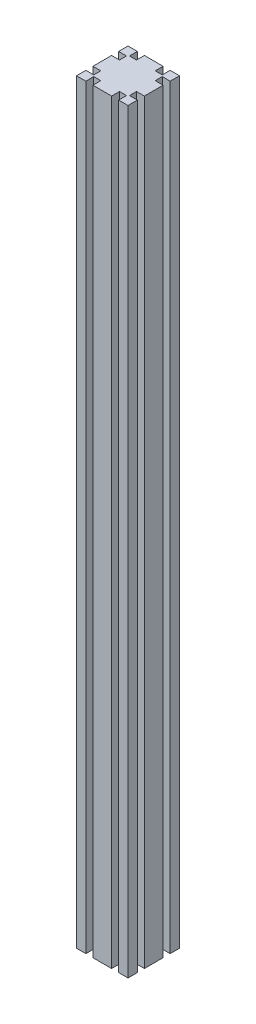
ISO-10303-21;
HEADER;
FILE_DESCRIPTION(('STEP AP214'),'2;1');
FILE_NAME('part.step','',(''),(''),'','','');
FILE_SCHEMA(('AUTOMOTIVE_DESIGN { 1 0 10303 214 1 1 1 1 }'));
ENDSEC;
DATA;
#1=APPLICATION_CONTEXT('core data for automotive mechanical design processes');
#2=APPLICATION_PROTOCOL_DEFINITION('international standard','automotive_design',2000,#1);
#3=PRODUCT_CONTEXT('',#1,'mechanical');
#4=PRODUCT('Part','Part','',(#3));
#5=PRODUCT_RELATED_PRODUCT_CATEGORY('part','',(#4));
#6=PRODUCT_DEFINITION_FORMATION('','',#4);
#7=PRODUCT_DEFINITION_CONTEXT('part definition',#1,'design');
#8=PRODUCT_DEFINITION('design','',#6,#7);
#9=PRODUCT_DEFINITION_SHAPE('','',#8);
#10=(LENGTH_UNIT() NAMED_UNIT(*) SI_UNIT(.MILLI.,.METRE.));
#11=(NAMED_UNIT(*) PLANE_ANGLE_UNIT() SI_UNIT($,.RADIAN.));
#12=(NAMED_UNIT(*) SI_UNIT($,.STERADIAN.) SOLID_ANGLE_UNIT());
#13=UNCERTAINTY_MEASURE_WITH_UNIT(LENGTH_MEASURE(1.E-05),#10,'distance_accuracy_value','');
#14=(GEOMETRIC_REPRESENTATION_CONTEXT(3) GLOBAL_UNCERTAINTY_ASSIGNED_CONTEXT((#13)) GLOBAL_UNIT_ASSIGNED_CONTEXT((#10,
#11,#12)) REPRESENTATION_CONTEXT('',''));
#15=CARTESIAN_POINT('',(0.,0.,0.));
#16=DIRECTION('',(0.,0.,1.));
#17=DIRECTION('',(1.,0.,0.));
#18=AXIS2_PLACEMENT_3D('',#15,#16,#17);
#19=CARTESIAN_POINT('',(19.1,880.,0.));
#20=DIRECTION('',(-1.,0.,0.));
#21=DIRECTION('',(0.,0.,1.));
#22=AXIS2_PLACEMENT_3D('',#19,#20,#21);
#23=PLANE('',#22);
#24=DIRECTION('',(0.,0.,-1.));
#25=VECTOR('',#24,1.);
#26=CARTESIAN_POINT('',(19.1,0.,0.));
#27=LINE('',#26,#25);
#28=CARTESIAN_POINT('',(19.1,0.,-50.8));
#29=VERTEX_POINT('',#28);
#30=CARTESIAN_POINT('',(19.1,0.,-60.));
#31=VERTEX_POINT('',#30);
#32=EDGE_CURVE('E298',#29,#31,#27,.T.);
#33=ORIENTED_EDGE('',*,*,#32,.F.);
#34=DIRECTION('',(0.,-1.,0.));
#35=VECTOR('',#34,1.);
#36=CARTESIAN_POINT('',(19.1,880.,-50.8));
#37=LINE('',#36,#35);
#38=CARTESIAN_POINT('',(19.1,880.,-50.8));
#39=VERTEX_POINT('',#38);
#40=EDGE_CURVE('E11',#39,#29,#37,.T.);
#41=ORIENTED_EDGE('',*,*,#40,.F.);
#42=DIRECTION('',(0.,0.,-1.));
#43=VECTOR('',#42,1.);
#44=CARTESIAN_POINT('',(19.1,880.,0.));
#45=LINE('',#44,#43);
#46=CARTESIAN_POINT('',(19.1,880.,-60.));
#47=VERTEX_POINT('',#46);
#48=EDGE_CURVE('E478',#39,#47,#45,.T.);
#49=ORIENTED_EDGE('',*,*,#48,.T.);
#50=DIRECTION('',(0.,-1.,0.));
#51=VECTOR('',#50,1.);
#52=CARTESIAN_POINT('',(19.1,880.,-60.));
#53=LINE('',#52,#51);
#54=EDGE_CURVE('E51',#47,#31,#53,.T.);
#55=ORIENTED_EDGE('',*,*,#54,.T.);
#56=EDGE_LOOP('',(#33,#41,#49,#55));
#57=FACE_BOUND('',#56,.T.);
#58=ADVANCED_FACE('F35',(#57),#23,.T.);
#59=CARTESIAN_POINT('',(0.,880.,-50.8));
#60=DIRECTION('',(0.,0.,-1.));
#61=DIRECTION('',(-1.,0.,0.));
#62=AXIS2_PLACEMENT_3D('',#59,#60,#61);
#63=PLANE('',#62);
#64=DIRECTION('',(1.,0.,0.));
#65=VECTOR('',#64,1.);
#66=CARTESIAN_POINT('',(0.,0.,-50.8));
#67=LINE('',#66,#65);
#68=CARTESIAN_POINT('',(10.9,0.,-50.8));
#69=VERTEX_POINT('',#68);
#70=EDGE_CURVE('E300',#69,#29,#67,.T.);
#71=ORIENTED_EDGE('',*,*,#70,.F.);
#72=DIRECTION('',(0.,-1.,0.));
#73=VECTOR('',#72,1.);
#74=CARTESIAN_POINT('',(10.9,880.,-50.8));
#75=LINE('',#74,#73);
#76=CARTESIAN_POINT('',(10.9,880.,-50.8));
#77=VERTEX_POINT('',#76);
#78=EDGE_CURVE('E43',#77,#69,#75,.T.);
#79=ORIENTED_EDGE('',*,*,#78,.F.);
#80=DIRECTION('',(1.,0.,0.));
#81=VECTOR('',#80,1.);
#82=CARTESIAN_POINT('',(0.,880.,-50.8));
#83=LINE('',#82,#81);
#84=EDGE_CURVE('E475',#77,#39,#83,.T.);
#85=ORIENTED_EDGE('',*,*,#84,.T.);
#86=ORIENTED_EDGE('',*,*,#40,.T.);
#87=EDGE_LOOP('',(#71,#79,#85,#86));
#88=FACE_BOUND('',#87,.T.);
#89=ADVANCED_FACE('F464',(#88),#63,.T.);
#90=CARTESIAN_POINT('',(10.9,880.,0.));
#91=DIRECTION('',(1.,0.,0.));
#92=DIRECTION('',(0.,0.,-1.));
#93=AXIS2_PLACEMENT_3D('',#90,#91,#92);
#94=PLANE('',#93);
#95=DIRECTION('',(0.,0.,1.));
#96=VECTOR('',#95,1.);
#97=CARTESIAN_POINT('',(10.9,0.,0.));
#98=LINE('',#97,#96);
#99=CARTESIAN_POINT('',(10.9,0.,-60.));
#100=VERTEX_POINT('',#99);
#101=EDGE_CURVE('E303',#100,#69,#98,.T.);
#102=ORIENTED_EDGE('',*,*,#101,.F.);
#103=DIRECTION('',(0.,-1.,0.));
#104=VECTOR('',#103,1.);
#105=CARTESIAN_POINT('',(10.9,880.,-60.));
#106=LINE('',#105,#104);
#107=CARTESIAN_POINT('',(10.9,880.,-60.));
#108=VERTEX_POINT('',#107);
#109=EDGE_CURVE('E453',#108,#100,#106,.T.);
#110=ORIENTED_EDGE('',*,*,#109,.F.);
#111=DIRECTION('',(0.,0.,1.));
#112=VECTOR('',#111,1.);
#113=CARTESIAN_POINT('',(10.9,880.,0.));
#114=LINE('',#113,#112);
#115=EDGE_CURVE('E460',#108,#77,#114,.T.);
#116=ORIENTED_EDGE('',*,*,#115,.T.);
#117=ORIENTED_EDGE('',*,*,#78,.T.);
#118=EDGE_LOOP('',(#102,#110,#116,#117));
#119=FACE_BOUND('',#118,.T.);
#120=ADVANCED_FACE('F458',(#119),#94,.T.);
#121=CARTESIAN_POINT('',(0.,880.,-60.));
#122=DIRECTION('',(0.,0.,-1.));
#123=DIRECTION('',(-1.,0.,0.));
#124=AXIS2_PLACEMENT_3D('',#121,#122,#123);
#125=PLANE('',#124);
#126=DIRECTION('',(1.,0.,0.));
#127=VECTOR('',#126,1.);
#128=CARTESIAN_POINT('',(0.,0.,-60.));
#129=LINE('',#128,#127);
#130=CARTESIAN_POINT('',(0.,0.,-60.));
#131=VERTEX_POINT('',#130);
#132=EDGE_CURVE('E306',#131,#100,#129,.T.);
#133=ORIENTED_EDGE('',*,*,#132,.F.);
#134=DIRECTION('',(0.,-1.,0.));
#135=VECTOR('',#134,1.);
#136=CARTESIAN_POINT('',(0.,880.,-60.));
#137=LINE('',#136,#135);
#138=CARTESIAN_POINT('',(0.,880.,-60.));
#139=VERTEX_POINT('',#138);
#140=EDGE_CURVE('E451',#139,#131,#137,.T.);
#141=ORIENTED_EDGE('',*,*,#140,.F.);
#142=DIRECTION('',(1.,0.,0.));
#143=VECTOR('',#142,1.);
#144=CARTESIAN_POINT('',(0.,880.,-60.));
#145=LINE('',#144,#143);
#146=EDGE_CURVE('E295',#139,#108,#145,.T.);
#147=ORIENTED_EDGE('',*,*,#146,.T.);
#148=ORIENTED_EDGE('',*,*,#109,.T.);
#149=EDGE_LOOP('',(#133,#141,#147,#148));
#150=FACE_BOUND('',#149,.T.);
#151=ADVANCED_FACE('F471',(#150),#125,.T.);
#152=CARTESIAN_POINT('',(0.,880.,0.));
#153=DIRECTION('',(1.,0.,0.));
#154=DIRECTION('',(0.,0.,-1.));
#155=AXIS2_PLACEMENT_3D('',#152,#153,#154);
#156=PLANE('',#155);
#157=DIRECTION('',(0.,0.,1.));
#158=VECTOR('',#157,1.);
#159=CARTESIAN_POINT('',(0.,0.,0.));
#160=LINE('',#159,#158);
#161=CARTESIAN_POINT('',(0.,0.,-49.1));
#162=VERTEX_POINT('',#161);
#163=EDGE_CURVE('E309',#131,#162,#160,.T.);
#164=ORIENTED_EDGE('',*,*,#163,.T.);
#165=DIRECTION('',(0.,-1.,0.));
#166=VECTOR('',#165,1.);
#167=CARTESIAN_POINT('',(0.,880.,-49.1));
#168=LINE('',#167,#166);
#169=CARTESIAN_POINT('',(0.,880.,-49.1));
#170=VERTEX_POINT('',#169);
#171=EDGE_CURVE('E448',#170,#162,#168,.T.);
#172=ORIENTED_EDGE('',*,*,#171,.F.);
#173=DIRECTION('',(0.,0.,1.));
#174=VECTOR('',#173,1.);
#175=CARTESIAN_POINT('',(0.,880.,0.));
#176=LINE('',#175,#174);
#177=EDGE_CURVE('E477',#139,#170,#176,.T.);
#178=ORIENTED_EDGE('',*,*,#177,.F.);
#179=ORIENTED_EDGE('',*,*,#140,.T.);
#180=EDGE_LOOP('',(#164,#172,#178,#179));
#181=FACE_BOUND('',#180,.T.);
#182=ADVANCED_FACE('F600',(#181),#156,.F.);
#183=CARTESIAN_POINT('',(0.,880.,-49.1));
#184=DIRECTION('',(0.,0.,-1.));
#185=DIRECTION('',(-1.,0.,0.));
#186=AXIS2_PLACEMENT_3D('',#183,#184,#185);
#187=PLANE('',#186);
#188=DIRECTION('',(1.,0.,0.));
#189=VECTOR('',#188,1.);
#190=CARTESIAN_POINT('',(0.,0.,-49.1));
#191=LINE('',#190,#189);
#192=CARTESIAN_POINT('',(9.2,0.,-49.1));
#193=VERTEX_POINT('',#192);
#194=EDGE_CURVE('E312',#162,#193,#191,.T.);
#195=ORIENTED_EDGE('',*,*,#194,.T.);
#196=DIRECTION('',(0.,-1.,0.));
#197=VECTOR('',#196,1.);
#198=CARTESIAN_POINT('',(9.2,880.,-49.1));
#199=LINE('',#198,#197);
#200=CARTESIAN_POINT('',(9.2,880.,-49.1));
#201=VERTEX_POINT('',#200);
#202=EDGE_CURVE('E445',#201,#193,#199,.T.);
#203=ORIENTED_EDGE('',*,*,#202,.F.);
#204=DIRECTION('',(1.,0.,0.));
#205=VECTOR('',#204,1.);
#206=CARTESIAN_POINT('',(0.,880.,-49.1));
#207=LINE('',#206,#205);
#208=EDGE_CURVE('E483',#170,#201,#207,.T.);
#209=ORIENTED_EDGE('',*,*,#208,.F.);
#210=ORIENTED_EDGE('',*,*,#171,.T.);
#211=EDGE_LOOP('',(#195,#203,#209,#210));
#212=FACE_BOUND('',#211,.T.);
#213=ADVANCED_FACE('F605',(#212),#187,.F.);
#214=CARTESIAN_POINT('',(9.20000000000001,880.,0.));
#215=DIRECTION('',(1.,0.,0.));
#216=DIRECTION('',(0.,0.,-1.));
#217=AXIS2_PLACEMENT_3D('',#214,#215,#216);
#218=PLANE('',#217);
#219=DIRECTION('',(0.,0.,1.));
#220=VECTOR('',#219,1.);
#221=CARTESIAN_POINT('',(9.20000000000001,0.,0.));
#222=LINE('',#221,#220);
#223=CARTESIAN_POINT('',(9.2,0.,-40.9));
#224=VERTEX_POINT('',#223);
#225=EDGE_CURVE('E314',#193,#224,#222,.T.);
#226=ORIENTED_EDGE('',*,*,#225,.T.);
#227=DIRECTION('',(0.,-1.,0.));
#228=VECTOR('',#227,1.);
#229=CARTESIAN_POINT('',(9.2,880.,-40.9));
#230=LINE('',#229,#228);
#231=CARTESIAN_POINT('',(9.2,880.,-40.9));
#232=VERTEX_POINT('',#231);
#233=EDGE_CURVE('E442',#232,#224,#230,.T.);
#234=ORIENTED_EDGE('',*,*,#233,.F.);
#235=DIRECTION('',(0.,0.,1.));
#236=VECTOR('',#235,1.);
#237=CARTESIAN_POINT('',(9.20000000000001,880.,0.));
#238=LINE('',#237,#236);
#239=EDGE_CURVE('E485',#201,#232,#238,.T.);
#240=ORIENTED_EDGE('',*,*,#239,.F.);
#241=ORIENTED_EDGE('',*,*,#202,.T.);
#242=EDGE_LOOP('',(#226,#234,#240,#241));
#243=FACE_BOUND('',#242,.T.);
#244=ADVANCED_FACE('F614',(#243),#218,.F.);
#245=CARTESIAN_POINT('',(0.,880.,-40.9));
#246=DIRECTION('',(0.,0.,1.));
#247=DIRECTION('',(1.,0.,0.));
#248=AXIS2_PLACEMENT_3D('',#245,#246,#247);
#249=PLANE('',#248);
#250=DIRECTION('',(-1.,0.,0.));
#251=VECTOR('',#250,1.);
#252=CARTESIAN_POINT('',(0.,0.,-40.9));
#253=LINE('',#252,#251);
#254=CARTESIAN_POINT('',(0.,0.,-40.9));
#255=VERTEX_POINT('',#254);
#256=EDGE_CURVE('E316',#224,#255,#253,.T.);
#257=ORIENTED_EDGE('',*,*,#256,.T.);
#258=DIRECTION('',(0.,-1.,0.));
#259=VECTOR('',#258,1.);
#260=CARTESIAN_POINT('',(0.,880.,-40.9));
#261=LINE('',#260,#259);
#262=CARTESIAN_POINT('',(0.,880.,-40.9));
#263=VERTEX_POINT('',#262);
#264=EDGE_CURVE('E440',#263,#255,#261,.T.);
#265=ORIENTED_EDGE('',*,*,#264,.F.);
#266=DIRECTION('',(-1.,0.,0.));
#267=VECTOR('',#266,1.);
#268=CARTESIAN_POINT('',(0.,880.,-40.9));
#269=LINE('',#268,#267);
#270=EDGE_CURVE('E487',#232,#263,#269,.T.);
#271=ORIENTED_EDGE('',*,*,#270,.F.);
#272=ORIENTED_EDGE('',*,*,#233,.T.);
#273=EDGE_LOOP('',(#257,#265,#271,#272));
#274=FACE_BOUND('',#273,.T.);
#275=ADVANCED_FACE('F618',(#274),#249,.F.);
#276=CARTESIAN_POINT('',(0.,880.,0.));
#277=DIRECTION('',(-1.,0.,0.));
#278=DIRECTION('',(0.,0.,1.));
#279=AXIS2_PLACEMENT_3D('',#276,#277,#278);
#280=PLANE('',#279);
#281=DIRECTION('',(0.,0.,-1.));
#282=VECTOR('',#281,1.);
#283=CARTESIAN_POINT('',(0.,0.,0.));
#284=LINE('',#283,#282);
#285=CARTESIAN_POINT('',(0.,0.,-19.1));
#286=VERTEX_POINT('',#285);
#287=EDGE_CURVE('E319',#286,#255,#284,.T.);
#288=ORIENTED_EDGE('',*,*,#287,.F.);
#289=DIRECTION('',(0.,-1.,0.));
#290=VECTOR('',#289,1.);
#291=CARTESIAN_POINT('',(0.,880.,-19.1));
#292=LINE('',#291,#290);
#293=CARTESIAN_POINT('',(0.,880.,-19.1));
#294=VERTEX_POINT('',#293);
#295=EDGE_CURVE('E438',#294,#286,#292,.T.);
#296=ORIENTED_EDGE('',*,*,#295,.F.);
#297=DIRECTION('',(0.,0.,-1.));
#298=VECTOR('',#297,1.);
#299=CARTESIAN_POINT('',(0.,880.,0.));
#300=LINE('',#299,#298);
#301=EDGE_CURVE('E489',#294,#263,#300,.T.);
#302=ORIENTED_EDGE('',*,*,#301,.T.);
#303=ORIENTED_EDGE('',*,*,#264,.T.);
#304=EDGE_LOOP('',(#288,#296,#302,#303));
#305=FACE_BOUND('',#304,.T.);
#306=ADVANCED_FACE('F622',(#305),#280,.T.);
#307=CARTESIAN_POINT('',(0.,880.,-19.1));
#308=DIRECTION('',(0.,0.,1.));
#309=DIRECTION('',(1.,0.,0.));
#310=AXIS2_PLACEMENT_3D('',#307,#308,#309);
#311=PLANE('',#310);
#312=DIRECTION('',(-1.,0.,0.));
#313=VECTOR('',#312,1.);
#314=CARTESIAN_POINT('',(0.,0.,-19.1));
#315=LINE('',#314,#313);
#316=CARTESIAN_POINT('',(9.20000000000002,0.,-19.1));
#317=VERTEX_POINT('',#316);
#318=EDGE_CURVE('E322',#317,#286,#315,.T.);
#319=ORIENTED_EDGE('',*,*,#318,.F.);
#320=DIRECTION('',(0.,-1.,0.));
#321=VECTOR('',#320,1.);
#322=CARTESIAN_POINT('',(9.20000000000002,880.,-19.1));
#323=LINE('',#322,#321);
#324=CARTESIAN_POINT('',(9.20000000000002,880.,-19.1));
#325=VERTEX_POINT('',#324);
#326=EDGE_CURVE('E436',#325,#317,#323,.T.);
#327=ORIENTED_EDGE('',*,*,#326,.F.);
#328=DIRECTION('',(-1.,0.,0.));
#329=VECTOR('',#328,1.);
#330=CARTESIAN_POINT('',(0.,880.,-19.1));
#331=LINE('',#330,#329);
#332=EDGE_CURVE('E492',#325,#294,#331,.T.);
#333=ORIENTED_EDGE('',*,*,#332,.T.);
#334=ORIENTED_EDGE('',*,*,#295,.T.);
#335=EDGE_LOOP('',(#319,#327,#333,#334));
#336=FACE_BOUND('',#335,.T.);
#337=ADVANCED_FACE('F626',(#336),#311,.T.);
#338=CARTESIAN_POINT('',(9.2,880.,0.));
#339=DIRECTION('',(-1.,0.,0.));
#340=DIRECTION('',(0.,0.,1.));
#341=AXIS2_PLACEMENT_3D('',#338,#339,#340);
#342=PLANE('',#341);
#343=DIRECTION('',(0.,0.,-1.));
#344=VECTOR('',#343,1.);
#345=CARTESIAN_POINT('',(9.2,0.,0.));
#346=LINE('',#345,#344);
#347=CARTESIAN_POINT('',(9.20000000000001,0.,-10.9));
#348=VERTEX_POINT('',#347);
#349=EDGE_CURVE('E325',#348,#317,#346,.T.);
#350=ORIENTED_EDGE('',*,*,#349,.F.);
#351=DIRECTION('',(0.,-1.,0.));
#352=VECTOR('',#351,1.);
#353=CARTESIAN_POINT('',(9.20000000000001,880.,-10.9));
#354=LINE('',#353,#352);
#355=CARTESIAN_POINT('',(9.20000000000001,880.,-10.9));
#356=VERTEX_POINT('',#355);
#357=EDGE_CURVE('E434',#356,#348,#354,.T.);
#358=ORIENTED_EDGE('',*,*,#357,.F.);
#359=DIRECTION('',(0.,0.,-1.));
#360=VECTOR('',#359,1.);
#361=CARTESIAN_POINT('',(9.2,880.,0.));
#362=LINE('',#361,#360);
#363=EDGE_CURVE('E495',#356,#325,#362,.T.);
#364=ORIENTED_EDGE('',*,*,#363,.T.);
#365=ORIENTED_EDGE('',*,*,#326,.T.);
#366=EDGE_LOOP('',(#350,#358,#364,#365));
#367=FACE_BOUND('',#366,.T.);
#368=ADVANCED_FACE('F630',(#367),#342,.T.);
#369=CARTESIAN_POINT('',(0.,880.,-10.9));
#370=DIRECTION('',(0.,0.,-1.));
#371=DIRECTION('',(-1.,0.,0.));
#372=AXIS2_PLACEMENT_3D('',#369,#370,#371);
#373=PLANE('',#372);
#374=DIRECTION('',(1.,0.,0.));
#375=VECTOR('',#374,1.);
#376=CARTESIAN_POINT('',(0.,0.,-10.9));
#377=LINE('',#376,#375);
#378=CARTESIAN_POINT('',(0.,0.,-10.9));
#379=VERTEX_POINT('',#378);
#380=EDGE_CURVE('E328',#379,#348,#377,.T.);
#381=ORIENTED_EDGE('',*,*,#380,.F.);
#382=DIRECTION('',(0.,-1.,0.));
#383=VECTOR('',#382,1.);
#384=CARTESIAN_POINT('',(0.,880.,-10.9));
#385=LINE('',#384,#383);
#386=CARTESIAN_POINT('',(0.,880.,-10.9));
#387=VERTEX_POINT('',#386);
#388=EDGE_CURVE('E432',#387,#379,#385,.T.);
#389=ORIENTED_EDGE('',*,*,#388,.F.);
#390=DIRECTION('',(1.,0.,0.));
#391=VECTOR('',#390,1.);
#392=CARTESIAN_POINT('',(0.,880.,-10.9));
#393=LINE('',#392,#391);
#394=EDGE_CURVE('E498',#387,#356,#393,.T.);
#395=ORIENTED_EDGE('',*,*,#394,.T.);
#396=ORIENTED_EDGE('',*,*,#357,.T.);
#397=EDGE_LOOP('',(#381,#389,#395,#396));
#398=FACE_BOUND('',#397,.T.);
#399=ADVANCED_FACE('F634',(#398),#373,.T.);
#400=CARTESIAN_POINT('',(0.,880.,0.));
#401=DIRECTION('',(-1.,0.,0.));
#402=DIRECTION('',(0.,0.,1.));
#403=AXIS2_PLACEMENT_3D('',#400,#401,#402);
#404=PLANE('',#403);
#405=DIRECTION('',(0.,0.,-1.));
#406=VECTOR('',#405,1.);
#407=CARTESIAN_POINT('',(0.,0.,0.));
#408=LINE('',#407,#406);
#409=CARTESIAN_POINT('',(0.,0.,0.));
#410=VERTEX_POINT('',#409);
#411=EDGE_CURVE('E331',#410,#379,#408,.T.);
#412=ORIENTED_EDGE('',*,*,#411,.F.);
#413=DIRECTION('',(0.,-1.,0.));
#414=VECTOR('',#413,1.);
#415=CARTESIAN_POINT('',(0.,880.,0.));
#416=LINE('',#415,#414);
#417=CARTESIAN_POINT('',(0.,880.,0.));
#418=VERTEX_POINT('',#417);
#419=EDGE_CURVE('E430',#418,#410,#416,.T.);
#420=ORIENTED_EDGE('',*,*,#419,.F.);
#421=DIRECTION('',(0.,0.,-1.));
#422=VECTOR('',#421,1.);
#423=CARTESIAN_POINT('',(0.,880.,0.));
#424=LINE('',#423,#422);
#425=EDGE_CURVE('E501',#418,#387,#424,.T.);
#426=ORIENTED_EDGE('',*,*,#425,.T.);
#427=ORIENTED_EDGE('',*,*,#388,.T.);
#428=EDGE_LOOP('',(#412,#420,#426,#427));
#429=FACE_BOUND('',#428,.T.);
#430=ADVANCED_FACE('F638',(#429),#404,.T.);
#431=CARTESIAN_POINT('',(0.,880.,0.));
#432=DIRECTION('',(0.,0.,-1.));
#433=DIRECTION('',(-1.,0.,0.));
#434=AXIS2_PLACEMENT_3D('',#431,#432,#433);
#435=PLANE('',#434);
#436=DIRECTION('',(1.,0.,0.));
#437=VECTOR('',#436,1.);
#438=CARTESIAN_POINT('',(0.,0.,0.));
#439=LINE('',#438,#437);
#440=CARTESIAN_POINT('',(10.9,0.,0.));
#441=VERTEX_POINT('',#440);
#442=EDGE_CURVE('E334',#410,#441,#439,.T.);
#443=ORIENTED_EDGE('',*,*,#442,.T.);
#444=DIRECTION('',(0.,-1.,0.));
#445=VECTOR('',#444,1.);
#446=CARTESIAN_POINT('',(10.9,880.,0.));
#447=LINE('',#446,#445);
#448=CARTESIAN_POINT('',(10.9,880.,0.));
#449=VERTEX_POINT('',#448);
#450=EDGE_CURVE('E427',#449,#441,#447,.T.);
#451=ORIENTED_EDGE('',*,*,#450,.F.);
#452=DIRECTION('',(1.,0.,0.));
#453=VECTOR('',#452,1.);
#454=CARTESIAN_POINT('',(0.,880.,0.));
#455=LINE('',#454,#453);
#456=EDGE_CURVE('E504',#418,#449,#455,.T.);
#457=ORIENTED_EDGE('',*,*,#456,.F.);
#458=ORIENTED_EDGE('',*,*,#419,.T.);
#459=EDGE_LOOP('',(#443,#451,#457,#458));
#460=FACE_BOUND('',#459,.T.);
#461=ADVANCED_FACE('F642',(#460),#435,.F.);
#462=CARTESIAN_POINT('',(10.9,880.,0.));
#463=DIRECTION('',(-1.,0.,0.));
#464=DIRECTION('',(0.,0.,1.));
#465=AXIS2_PLACEMENT_3D('',#462,#463,#464);
#466=PLANE('',#465);
#467=DIRECTION('',(0.,0.,-1.));
#468=VECTOR('',#467,1.);
#469=CARTESIAN_POINT('',(10.9,0.,0.));
#470=LINE('',#469,#468);
#471=CARTESIAN_POINT('',(10.9,0.,-9.20000000000001));
#472=VERTEX_POINT('',#471);
#473=EDGE_CURVE('E336',#441,#472,#470,.T.);
#474=ORIENTED_EDGE('',*,*,#473,.T.);
#475=DIRECTION('',(0.,-1.,0.));
#476=VECTOR('',#475,1.);
#477=CARTESIAN_POINT('',(10.9,880.,-9.20000000000001));
#478=LINE('',#477,#476);
#479=CARTESIAN_POINT('',(10.9,880.,-9.20000000000001));
#480=VERTEX_POINT('',#479);
#481=EDGE_CURVE('E424',#480,#472,#478,.T.);
#482=ORIENTED_EDGE('',*,*,#481,.F.);
#483=DIRECTION('',(0.,0.,-1.));
#484=VECTOR('',#483,1.);
#485=CARTESIAN_POINT('',(10.9,880.,0.));
#486=LINE('',#485,#484);
#487=EDGE_CURVE('E506',#449,#480,#486,.T.);
#488=ORIENTED_EDGE('',*,*,#487,.F.);
#489=ORIENTED_EDGE('',*,*,#450,.T.);
#490=EDGE_LOOP('',(#474,#482,#488,#489));
#491=FACE_BOUND('',#490,.T.);
#492=ADVANCED_FACE('F644',(#491),#466,.F.);
#493=CARTESIAN_POINT('',(0.,880.,-9.19999999999999));
#494=DIRECTION('',(0.,0.,-1.));
#495=DIRECTION('',(-1.,0.,0.));
#496=AXIS2_PLACEMENT_3D('',#493,#494,#495);
#497=PLANE('',#496);
#498=DIRECTION('',(1.,0.,0.));
#499=VECTOR('',#498,1.);
#500=CARTESIAN_POINT('',(0.,0.,-9.19999999999999));
#501=LINE('',#500,#499);
#502=CARTESIAN_POINT('',(19.1,0.,-9.20000000000003));
#503=VERTEX_POINT('',#502);
#504=EDGE_CURVE('E340',#472,#503,#501,.T.);
#505=ORIENTED_EDGE('',*,*,#504,.T.);
#506=DIRECTION('',(0.,-1.,0.));
#507=VECTOR('',#506,1.);
#508=CARTESIAN_POINT('',(19.1,880.,-9.20000000000003));
#509=LINE('',#508,#507);
#510=CARTESIAN_POINT('',(19.1,880.,-9.20000000000003));
#511=VERTEX_POINT('',#510);
#512=EDGE_CURVE('E421',#511,#503,#509,.T.);
#513=ORIENTED_EDGE('',*,*,#512,.F.);
#514=DIRECTION('',(1.,0.,0.));
#515=VECTOR('',#514,1.);
#516=CARTESIAN_POINT('',(0.,880.,-9.19999999999999));
#517=LINE('',#516,#515);
#518=EDGE_CURVE('E510',#480,#511,#517,.T.);
#519=ORIENTED_EDGE('',*,*,#518,.F.);
#520=ORIENTED_EDGE('',*,*,#481,.T.);
#521=EDGE_LOOP('',(#505,#513,#519,#520));
#522=FACE_BOUND('',#521,.T.);
#523=ADVANCED_FACE('F647',(#522),#497,.F.);
#524=CARTESIAN_POINT('',(19.1,880.,0.));
#525=DIRECTION('',(1.,0.,0.));
#526=DIRECTION('',(0.,0.,-1.));
#527=AXIS2_PLACEMENT_3D('',#524,#525,#526);
#528=PLANE('',#527);
#529=DIRECTION('',(0.,0.,1.));
#530=VECTOR('',#529,1.);
#531=CARTESIAN_POINT('',(19.1,0.,0.));
#532=LINE('',#531,#530);
#533=CARTESIAN_POINT('',(19.1,0.,0.));
#534=VERTEX_POINT('',#533);
#535=EDGE_CURVE('E342',#503,#534,#532,.T.);
#536=ORIENTED_EDGE('',*,*,#535,.T.);
#537=DIRECTION('',(0.,-1.,0.));
#538=VECTOR('',#537,1.);
#539=CARTESIAN_POINT('',(19.1,880.,0.));
#540=LINE('',#539,#538);
#541=CARTESIAN_POINT('',(19.1,880.,0.));
#542=VERTEX_POINT('',#541);
#543=EDGE_CURVE('E418',#542,#534,#540,.T.);
#544=ORIENTED_EDGE('',*,*,#543,.F.);
#545=DIRECTION('',(0.,0.,1.));
#546=VECTOR('',#545,1.);
#547=CARTESIAN_POINT('',(19.1,880.,0.));
#548=LINE('',#547,#546);
#549=EDGE_CURVE('E512',#511,#542,#548,.T.);
#550=ORIENTED_EDGE('',*,*,#549,.F.);
#551=ORIENTED_EDGE('',*,*,#512,.T.);
#552=EDGE_LOOP('',(#536,#544,#550,#551));
#553=FACE_BOUND('',#552,.T.);
#554=ADVANCED_FACE('F651',(#553),#528,.F.);
#555=CARTESIAN_POINT('',(40.9,0.,0.));
#556=VERTEX_POINT('',#555);
#557=EDGE_CURVE('E338',#534,#556,#439,.T.);
#558=ORIENTED_EDGE('',*,*,#557,.T.);
#559=DIRECTION('',(0.,-1.,0.));
#560=VECTOR('',#559,1.);
#561=CARTESIAN_POINT('',(40.9,880.,0.));
#562=LINE('',#561,#560);
#563=CARTESIAN_POINT('',(40.9,880.,0.));
#564=VERTEX_POINT('',#563);
#565=EDGE_CURVE('E416',#564,#556,#562,.T.);
#566=ORIENTED_EDGE('',*,*,#565,.F.);
#567=EDGE_CURVE('E508',#542,#564,#455,.T.);
#568=ORIENTED_EDGE('',*,*,#567,.F.);
#569=ORIENTED_EDGE('',*,*,#543,.T.);
#570=EDGE_LOOP('',(#558,#566,#568,#569));
#571=FACE_BOUND('',#570,.T.);
#572=ADVANCED_FACE('F655',(#571),#435,.F.);
#573=CARTESIAN_POINT('',(40.9,880.,0.));
#574=DIRECTION('',(1.,0.,0.));
#575=DIRECTION('',(0.,0.,-1.));
#576=AXIS2_PLACEMENT_3D('',#573,#574,#575);
#577=PLANE('',#576);
#578=DIRECTION('',(0.,0.,1.));
#579=VECTOR('',#578,1.);
#580=CARTESIAN_POINT('',(40.9,0.,0.));
#581=LINE('',#580,#579);
#582=CARTESIAN_POINT('',(40.9,0.,-9.19999999999999));
#583=VERTEX_POINT('',#582);
#584=EDGE_CURVE('E344',#583,#556,#581,.T.);
#585=ORIENTED_EDGE('',*,*,#584,.F.);
#586=DIRECTION('',(0.,-1.,0.));
#587=VECTOR('',#586,1.);
#588=CARTESIAN_POINT('',(40.9,880.,-9.19999999999999));
#589=LINE('',#588,#587);
#590=CARTESIAN_POINT('',(40.9,880.,-9.19999999999999));
#591=VERTEX_POINT('',#590);
#592=EDGE_CURVE('E414',#591,#583,#589,.T.);
#593=ORIENTED_EDGE('',*,*,#592,.F.);
#594=DIRECTION('',(0.,0.,1.));
#595=VECTOR('',#594,1.);
#596=CARTESIAN_POINT('',(40.9,880.,0.));
#597=LINE('',#596,#595);
#598=EDGE_CURVE('E514',#591,#564,#597,.T.);
#599=ORIENTED_EDGE('',*,*,#598,.T.);
#600=ORIENTED_EDGE('',*,*,#565,.T.);
#601=EDGE_LOOP('',(#585,#593,#599,#600));
#602=FACE_BOUND('',#601,.T.);
#603=ADVANCED_FACE('F657',(#602),#577,.T.);
#604=CARTESIAN_POINT('',(0.,880.,-9.19999999999999));
#605=DIRECTION('',(0.,0.,1.));
#606=DIRECTION('',(1.,0.,0.));
#607=AXIS2_PLACEMENT_3D('',#604,#605,#606);
#608=PLANE('',#607);
#609=DIRECTION('',(-1.,0.,0.));
#610=VECTOR('',#609,1.);
#611=CARTESIAN_POINT('',(0.,0.,-9.19999999999999));
#612=LINE('',#611,#610);
#613=CARTESIAN_POINT('',(49.1,0.,-9.19999999999999));
#614=VERTEX_POINT('',#613);
#615=EDGE_CURVE('E347',#614,#583,#612,.T.);
#616=ORIENTED_EDGE('',*,*,#615,.F.);
#617=DIRECTION('',(0.,-1.,0.));
#618=VECTOR('',#617,1.);
#619=CARTESIAN_POINT('',(49.1,880.,-9.19999999999999));
#620=LINE('',#619,#618);
#621=CARTESIAN_POINT('',(49.1,880.,-9.19999999999999));
#622=VERTEX_POINT('',#621);
#623=EDGE_CURVE('E412',#622,#614,#620,.T.);
#624=ORIENTED_EDGE('',*,*,#623,.F.);
#625=DIRECTION('',(-1.,0.,0.));
#626=VECTOR('',#625,1.);
#627=CARTESIAN_POINT('',(0.,880.,-9.19999999999999));
#628=LINE('',#627,#626);
#629=EDGE_CURVE('E517',#622,#591,#628,.T.);
#630=ORIENTED_EDGE('',*,*,#629,.T.);
#631=ORIENTED_EDGE('',*,*,#592,.T.);
#632=EDGE_LOOP('',(#616,#624,#630,#631));
#633=FACE_BOUND('',#632,.T.);
#634=ADVANCED_FACE('F660',(#633),#608,.T.);
#635=CARTESIAN_POINT('',(49.1,880.,0.));
#636=DIRECTION('',(-1.,0.,0.));
#637=DIRECTION('',(0.,0.,1.));
#638=AXIS2_PLACEMENT_3D('',#635,#636,#637);
#639=PLANE('',#638);
#640=DIRECTION('',(0.,0.,-1.));
#641=VECTOR('',#640,1.);
#642=CARTESIAN_POINT('',(49.1,0.,0.));
#643=LINE('',#642,#641);
#644=CARTESIAN_POINT('',(49.1,0.,0.));
#645=VERTEX_POINT('',#644);
#646=EDGE_CURVE('E350',#645,#614,#643,.T.);
#647=ORIENTED_EDGE('',*,*,#646,.F.);
#648=DIRECTION('',(0.,-1.,0.));
#649=VECTOR('',#648,1.);
#650=CARTESIAN_POINT('',(49.1,880.,0.));
#651=LINE('',#650,#649);
#652=CARTESIAN_POINT('',(49.1,880.,0.));
#653=VERTEX_POINT('',#652);
#654=EDGE_CURVE('E410',#653,#645,#651,.T.);
#655=ORIENTED_EDGE('',*,*,#654,.F.);
#656=DIRECTION('',(0.,0.,-1.));
#657=VECTOR('',#656,1.);
#658=CARTESIAN_POINT('',(49.1,880.,0.));
#659=LINE('',#658,#657);
#660=EDGE_CURVE('E520',#653,#622,#659,.T.);
#661=ORIENTED_EDGE('',*,*,#660,.T.);
#662=ORIENTED_EDGE('',*,*,#623,.T.);
#663=EDGE_LOOP('',(#647,#655,#661,#662));
#664=FACE_BOUND('',#663,.T.);
#665=ADVANCED_FACE('F664',(#664),#639,.T.);
#666=CARTESIAN_POINT('',(60.,0.,0.));
#667=VERTEX_POINT('',#666);
#668=EDGE_CURVE('E337',#645,#667,#439,.T.);
#669=ORIENTED_EDGE('',*,*,#668,.T.);
#670=DIRECTION('',(0.,-1.,0.));
#671=VECTOR('',#670,1.);
#672=CARTESIAN_POINT('',(60.,880.,0.));
#673=LINE('',#672,#671);
#674=CARTESIAN_POINT('',(60.,880.,0.));
#675=VERTEX_POINT('',#674);
#676=EDGE_CURVE('E407',#675,#667,#673,.T.);
#677=ORIENTED_EDGE('',*,*,#676,.F.);
#678=EDGE_CURVE('E507',#653,#675,#455,.T.);
#679=ORIENTED_EDGE('',*,*,#678,.F.);
#680=ORIENTED_EDGE('',*,*,#654,.T.);
#681=EDGE_LOOP('',(#669,#677,#679,#680));
#682=FACE_BOUND('',#681,.T.);
#683=ADVANCED_FACE('F668',(#682),#435,.F.);
#684=CARTESIAN_POINT('',(60.,880.,0.));
#685=DIRECTION('',(-1.,0.,0.));
#686=DIRECTION('',(0.,0.,1.));
#687=AXIS2_PLACEMENT_3D('',#684,#685,#686);
#688=PLANE('',#687);
#689=DIRECTION('',(0.,0.,-1.));
#690=VECTOR('',#689,1.);
#691=CARTESIAN_POINT('',(60.,0.,0.));
#692=LINE('',#691,#690);
#693=CARTESIAN_POINT('',(60.,0.,-10.9));
#694=VERTEX_POINT('',#693);
#695=EDGE_CURVE('E353',#667,#694,#692,.T.);
#696=ORIENTED_EDGE('',*,*,#695,.T.);
#697=DIRECTION('',(0.,-1.,0.));
#698=VECTOR('',#697,1.);
#699=CARTESIAN_POINT('',(60.,880.,-10.9));
#700=LINE('',#699,#698);
#701=CARTESIAN_POINT('',(60.,880.,-10.9));
#702=VERTEX_POINT('',#701);
#703=EDGE_CURVE('E404',#702,#694,#700,.T.);
#704=ORIENTED_EDGE('',*,*,#703,.F.);
#705=DIRECTION('',(0.,0.,-1.));
#706=VECTOR('',#705,1.);
#707=CARTESIAN_POINT('',(60.,880.,0.));
#708=LINE('',#707,#706);
#709=EDGE_CURVE('E523',#675,#702,#708,.T.);
#710=ORIENTED_EDGE('',*,*,#709,.F.);
#711=ORIENTED_EDGE('',*,*,#676,.T.);
#712=EDGE_LOOP('',(#696,#704,#710,#711));
#713=FACE_BOUND('',#712,.T.);
#714=ADVANCED_FACE('F672',(#713),#688,.F.);
#715=CARTESIAN_POINT('',(0.,880.,-10.9));
#716=DIRECTION('',(0.,0.,1.));
#717=DIRECTION('',(1.,0.,0.));
#718=AXIS2_PLACEMENT_3D('',#715,#716,#717);
#719=PLANE('',#718);
#720=DIRECTION('',(-1.,0.,0.));
#721=VECTOR('',#720,1.);
#722=CARTESIAN_POINT('',(0.,0.,-10.9));
#723=LINE('',#722,#721);
#724=CARTESIAN_POINT('',(50.8,0.,-10.9));
#725=VERTEX_POINT('',#724);
#726=EDGE_CURVE('E355',#694,#725,#723,.T.);
#727=ORIENTED_EDGE('',*,*,#726,.T.);
#728=DIRECTION('',(0.,-1.,0.));
#729=VECTOR('',#728,1.);
#730=CARTESIAN_POINT('',(50.8,880.,-10.9));
#731=LINE('',#730,#729);
#732=CARTESIAN_POINT('',(50.8,880.,-10.9));
#733=VERTEX_POINT('',#732);
#734=EDGE_CURVE('E401',#733,#725,#731,.T.);
#735=ORIENTED_EDGE('',*,*,#734,.F.);
#736=DIRECTION('',(-1.,0.,0.));
#737=VECTOR('',#736,1.);
#738=CARTESIAN_POINT('',(0.,880.,-10.9));
#739=LINE('',#738,#737);
#740=EDGE_CURVE('E525',#702,#733,#739,.T.);
#741=ORIENTED_EDGE('',*,*,#740,.F.);
#742=ORIENTED_EDGE('',*,*,#703,.T.);
#743=EDGE_LOOP('',(#727,#735,#741,#742));
#744=FACE_BOUND('',#743,.T.);
#745=ADVANCED_FACE('F674',(#744),#719,.F.);
#746=CARTESIAN_POINT('',(50.8,880.,0.));
#747=DIRECTION('',(-1.,0.,0.));
#748=DIRECTION('',(0.,0.,1.));
#749=AXIS2_PLACEMENT_3D('',#746,#747,#748);
#750=PLANE('',#749);
#751=DIRECTION('',(0.,0.,-1.));
#752=VECTOR('',#751,1.);
#753=CARTESIAN_POINT('',(50.8,0.,0.));
#754=LINE('',#753,#752);
#755=CARTESIAN_POINT('',(50.8,0.,-19.1));
#756=VERTEX_POINT('',#755);
#757=EDGE_CURVE('E359',#725,#756,#754,.T.);
#758=ORIENTED_EDGE('',*,*,#757,.T.);
#759=DIRECTION('',(0.,-1.,0.));
#760=VECTOR('',#759,1.);
#761=CARTESIAN_POINT('',(50.8,880.,-19.1));
#762=LINE('',#761,#760);
#763=CARTESIAN_POINT('',(50.8,880.,-19.1));
#764=VERTEX_POINT('',#763);
#765=EDGE_CURVE('E398',#764,#756,#762,.T.);
#766=ORIENTED_EDGE('',*,*,#765,.F.);
#767=DIRECTION('',(0.,0.,-1.));
#768=VECTOR('',#767,1.);
#769=CARTESIAN_POINT('',(50.8,880.,0.));
#770=LINE('',#769,#768);
#771=EDGE_CURVE('E529',#733,#764,#770,.T.);
#772=ORIENTED_EDGE('',*,*,#771,.F.);
#773=ORIENTED_EDGE('',*,*,#734,.T.);
#774=EDGE_LOOP('',(#758,#766,#772,#773));
#775=FACE_BOUND('',#774,.T.);
#776=ADVANCED_FACE('F677',(#775),#750,.F.);
#777=CARTESIAN_POINT('',(0.,880.,-19.1));
#778=DIRECTION('',(0.,0.,-1.));
#779=DIRECTION('',(-1.,0.,0.));
#780=AXIS2_PLACEMENT_3D('',#777,#778,#779);
#781=PLANE('',#780);
#782=DIRECTION('',(1.,0.,0.));
#783=VECTOR('',#782,1.);
#784=CARTESIAN_POINT('',(0.,0.,-19.1));
#785=LINE('',#784,#783);
#786=CARTESIAN_POINT('',(60.,0.,-19.1));
#787=VERTEX_POINT('',#786);
#788=EDGE_CURVE('E361',#756,#787,#785,.T.);
#789=ORIENTED_EDGE('',*,*,#788,.T.);
#790=DIRECTION('',(0.,-1.,0.));
#791=VECTOR('',#790,1.);
#792=CARTESIAN_POINT('',(60.,880.,-19.1));
#793=LINE('',#792,#791);
#794=CARTESIAN_POINT('',(60.,880.,-19.1));
#795=VERTEX_POINT('',#794);
#796=EDGE_CURVE('E395',#795,#787,#793,.T.);
#797=ORIENTED_EDGE('',*,*,#796,.F.);
#798=DIRECTION('',(1.,0.,0.));
#799=VECTOR('',#798,1.);
#800=CARTESIAN_POINT('',(0.,880.,-19.1));
#801=LINE('',#800,#799);
#802=EDGE_CURVE('E531',#764,#795,#801,.T.);
#803=ORIENTED_EDGE('',*,*,#802,.F.);
#804=ORIENTED_EDGE('',*,*,#765,.T.);
#805=EDGE_LOOP('',(#789,#797,#803,#804));
#806=FACE_BOUND('',#805,.T.);
#807=ADVANCED_FACE('F681',(#806),#781,.F.);
#808=CARTESIAN_POINT('',(60.,0.,-40.9));
#809=VERTEX_POINT('',#808);
#810=EDGE_CURVE('E357',#787,#809,#692,.T.);
#811=ORIENTED_EDGE('',*,*,#810,.T.);
#812=DIRECTION('',(0.,-1.,0.));
#813=VECTOR('',#812,1.);
#814=CARTESIAN_POINT('',(60.,880.,-40.9));
#815=LINE('',#814,#813);
#816=CARTESIAN_POINT('',(60.,880.,-40.9));
#817=VERTEX_POINT('',#816);
#818=EDGE_CURVE('E393',#817,#809,#815,.T.);
#819=ORIENTED_EDGE('',*,*,#818,.F.);
#820=EDGE_CURVE('E527',#795,#817,#708,.T.);
#821=ORIENTED_EDGE('',*,*,#820,.F.);
#822=ORIENTED_EDGE('',*,*,#796,.T.);
#823=EDGE_LOOP('',(#811,#819,#821,#822));
#824=FACE_BOUND('',#823,.T.);
#825=ADVANCED_FACE('F556',(#824),#688,.F.);
#826=CARTESIAN_POINT('',(0.,880.,-40.9));
#827=DIRECTION('',(0.,0.,-1.));
#828=DIRECTION('',(-1.,0.,0.));
#829=AXIS2_PLACEMENT_3D('',#826,#827,#828);
#830=PLANE('',#829);
#831=DIRECTION('',(1.,0.,0.));
#832=VECTOR('',#831,1.);
#833=CARTESIAN_POINT('',(0.,0.,-40.9));
#834=LINE('',#833,#832);
#835=CARTESIAN_POINT('',(50.8,0.,-40.9));
#836=VERTEX_POINT('',#835);
#837=EDGE_CURVE('E363',#836,#809,#834,.T.);
#838=ORIENTED_EDGE('',*,*,#837,.F.);
#839=DIRECTION('',(0.,-1.,0.));
#840=VECTOR('',#839,1.);
#841=CARTESIAN_POINT('',(50.8,880.,-40.9));
#842=LINE('',#841,#840);
#843=CARTESIAN_POINT('',(50.8,880.,-40.9));
#844=VERTEX_POINT('',#843);
#845=EDGE_CURVE('E391',#844,#836,#842,.T.);
#846=ORIENTED_EDGE('',*,*,#845,.F.);
#847=DIRECTION('',(1.,0.,0.));
#848=VECTOR('',#847,1.);
#849=CARTESIAN_POINT('',(0.,880.,-40.9));
#850=LINE('',#849,#848);
#851=EDGE_CURVE('E533',#844,#817,#850,.T.);
#852=ORIENTED_EDGE('',*,*,#851,.T.);
#853=ORIENTED_EDGE('',*,*,#818,.T.);
#854=EDGE_LOOP('',(#838,#846,#852,#853));
#855=FACE_BOUND('',#854,.T.);
#856=ADVANCED_FACE('F560',(#855),#830,.T.);
#857=CARTESIAN_POINT('',(50.7999999999999,880.,0.));
#858=DIRECTION('',(1.,0.,0.));
#859=DIRECTION('',(0.,0.,-1.));
#860=AXIS2_PLACEMENT_3D('',#857,#858,#859);
#861=PLANE('',#860);
#862=DIRECTION('',(0.,0.,1.));
#863=VECTOR('',#862,1.);
#864=CARTESIAN_POINT('',(50.7999999999999,0.,0.));
#865=LINE('',#864,#863);
#866=CARTESIAN_POINT('',(50.8,0.,-49.1));
#867=VERTEX_POINT('',#866);
#868=EDGE_CURVE('E366',#867,#836,#865,.T.);
#869=ORIENTED_EDGE('',*,*,#868,.F.);
#870=DIRECTION('',(0.,-1.,0.));
#871=VECTOR('',#870,1.);
#872=CARTESIAN_POINT('',(50.8,880.,-49.1));
#873=LINE('',#872,#871);
#874=CARTESIAN_POINT('',(50.8,880.,-49.1));
#875=VERTEX_POINT('',#874);
#876=EDGE_CURVE('E389',#875,#867,#873,.T.);
#877=ORIENTED_EDGE('',*,*,#876,.F.);
#878=DIRECTION('',(0.,0.,1.));
#879=VECTOR('',#878,1.);
#880=CARTESIAN_POINT('',(50.7999999999999,880.,0.));
#881=LINE('',#880,#879);
#882=EDGE_CURVE('E536',#875,#844,#881,.T.);
#883=ORIENTED_EDGE('',*,*,#882,.T.);
#884=ORIENTED_EDGE('',*,*,#845,.T.);
#885=EDGE_LOOP('',(#869,#877,#883,#884));
#886=FACE_BOUND('',#885,.T.);
#887=ADVANCED_FACE('F563',(#886),#861,.T.);
#888=CARTESIAN_POINT('',(0.,880.,-49.1));
#889=DIRECTION('',(0.,0.,1.));
#890=DIRECTION('',(1.,0.,0.));
#891=AXIS2_PLACEMENT_3D('',#888,#889,#890);
#892=PLANE('',#891);
#893=DIRECTION('',(-1.,0.,0.));
#894=VECTOR('',#893,1.);
#895=CARTESIAN_POINT('',(0.,0.,-49.1));
#896=LINE('',#895,#894);
#897=CARTESIAN_POINT('',(60.,0.,-49.1));
#898=VERTEX_POINT('',#897);
#899=EDGE_CURVE('E369',#898,#867,#896,.T.);
#900=ORIENTED_EDGE('',*,*,#899,.F.);
#901=DIRECTION('',(0.,-1.,0.));
#902=VECTOR('',#901,1.);
#903=CARTESIAN_POINT('',(60.,880.,-49.1));
#904=LINE('',#903,#902);
#905=CARTESIAN_POINT('',(60.,880.,-49.1));
#906=VERTEX_POINT('',#905);
#907=EDGE_CURVE('E387',#906,#898,#904,.T.);
#908=ORIENTED_EDGE('',*,*,#907,.F.);
#909=DIRECTION('',(-1.,0.,0.));
#910=VECTOR('',#909,1.);
#911=CARTESIAN_POINT('',(0.,880.,-49.1));
#912=LINE('',#911,#910);
#913=EDGE_CURVE('E539',#906,#875,#912,.T.);
#914=ORIENTED_EDGE('',*,*,#913,.T.);
#915=ORIENTED_EDGE('',*,*,#876,.T.);
#916=EDGE_LOOP('',(#900,#908,#914,#915));
#917=FACE_BOUND('',#916,.T.);
#918=ADVANCED_FACE('F566',(#917),#892,.T.);
#919=CARTESIAN_POINT('',(60.,0.,-60.));
#920=VERTEX_POINT('',#919);
#921=EDGE_CURVE('E356',#898,#920,#692,.T.);
#922=ORIENTED_EDGE('',*,*,#921,.T.);
#923=DIRECTION('',(0.,-1.,0.));
#924=VECTOR('',#923,1.);
#925=CARTESIAN_POINT('',(60.,880.,-60.));
#926=LINE('',#925,#924);
#927=CARTESIAN_POINT('',(60.,880.,-60.));
#928=VERTEX_POINT('',#927);
#929=EDGE_CURVE('E385',#928,#920,#926,.T.);
#930=ORIENTED_EDGE('',*,*,#929,.F.);
#931=EDGE_CURVE('E526',#906,#928,#708,.T.);
#932=ORIENTED_EDGE('',*,*,#931,.F.);
#933=ORIENTED_EDGE('',*,*,#907,.T.);
#934=EDGE_LOOP('',(#922,#930,#932,#933));
#935=FACE_BOUND('',#934,.T.);
#936=ADVANCED_FACE('F570',(#935),#688,.F.);
#937=CARTESIAN_POINT('',(0.,880.,-60.));
#938=DIRECTION('',(0.,0.,-1.));
#939=DIRECTION('',(-1.,0.,0.));
#940=AXIS2_PLACEMENT_3D('',#937,#938,#939);
#941=PLANE('',#940);
#942=DIRECTION('',(1.,0.,0.));
#943=VECTOR('',#942,1.);
#944=CARTESIAN_POINT('',(0.,0.,-60.));
#945=LINE('',#944,#943);
#946=CARTESIAN_POINT('',(49.1,0.,-60.));
#947=VERTEX_POINT('',#946);
#948=EDGE_CURVE('E372',#947,#920,#945,.T.);
#949=ORIENTED_EDGE('',*,*,#948,.F.);
#950=DIRECTION('',(0.,-1.,0.));
#951=VECTOR('',#950,1.);
#952=CARTESIAN_POINT('',(49.1,880.,-60.));
#953=LINE('',#952,#951);
#954=CARTESIAN_POINT('',(49.1,880.,-60.));
#955=VERTEX_POINT('',#954);
#956=EDGE_CURVE('E383',#955,#947,#953,.T.);
#957=ORIENTED_EDGE('',*,*,#956,.F.);
#958=DIRECTION('',(1.,0.,0.));
#959=VECTOR('',#958,1.);
#960=CARTESIAN_POINT('',(0.,880.,-60.));
#961=LINE('',#960,#959);
#962=EDGE_CURVE('E542',#955,#928,#961,.T.);
#963=ORIENTED_EDGE('',*,*,#962,.T.);
#964=ORIENTED_EDGE('',*,*,#929,.T.);
#965=EDGE_LOOP('',(#949,#957,#963,#964));
#966=FACE_BOUND('',#965,.T.);
#967=ADVANCED_FACE('F572',(#966),#941,.T.);
#968=CARTESIAN_POINT('',(49.1000000000001,880.,-1.11097725222341E-13));
#969=DIRECTION('',(1.,0.,0.));
#970=DIRECTION('',(0.,0.,-1.));
#971=AXIS2_PLACEMENT_3D('',#968,#969,#970);
#972=PLANE('',#971);
#973=DIRECTION('',(0.,0.,1.));
#974=VECTOR('',#973,1.);
#975=CARTESIAN_POINT('',(49.1000000000001,0.,-1.11097725222341E-13));
#976=LINE('',#975,#974);
#977=CARTESIAN_POINT('',(49.1,0.,-50.8));
#978=VERTEX_POINT('',#977);
#979=EDGE_CURVE('E375',#947,#978,#976,.T.);
#980=ORIENTED_EDGE('',*,*,#979,.T.);
#981=DIRECTION('',(0.,-1.,0.));
#982=VECTOR('',#981,1.);
#983=CARTESIAN_POINT('',(49.1,880.,-50.8));
#984=LINE('',#983,#982);
#985=CARTESIAN_POINT('',(49.1,880.,-50.8));
#986=VERTEX_POINT('',#985);
#987=EDGE_CURVE('E289',#986,#978,#984,.T.);
#988=ORIENTED_EDGE('',*,*,#987,.F.);
#989=DIRECTION('',(0.,0.,1.));
#990=VECTOR('',#989,1.);
#991=CARTESIAN_POINT('',(49.1000000000001,880.,-1.11097725222341E-13));
#992=LINE('',#991,#990);
#993=EDGE_CURVE('E277',#955,#986,#992,.T.);
#994=ORIENTED_EDGE('',*,*,#993,.F.);
#995=ORIENTED_EDGE('',*,*,#956,.T.);
#996=EDGE_LOOP('',(#980,#988,#994,#995));
#997=FACE_BOUND('',#996,.T.);
#998=ADVANCED_FACE('F575',(#997),#972,.F.);
#999=CARTESIAN_POINT('',(0.,880.,-50.7999999999999));
#1000=DIRECTION('',(0.,0.,1.));
#1001=DIRECTION('',(1.,0.,0.));
#1002=AXIS2_PLACEMENT_3D('',#999,#1000,#1001);
#1003=PLANE('',#1002);
#1004=DIRECTION('',(-1.,0.,0.));
#1005=VECTOR('',#1004,1.);
#1006=CARTESIAN_POINT('',(0.,0.,-50.7999999999999));
#1007=LINE('',#1006,#1005);
#1008=CARTESIAN_POINT('',(40.9,0.,-50.8));
#1009=VERTEX_POINT('',#1008);
#1010=EDGE_CURVE('E286',#978,#1009,#1007,.T.);
#1011=ORIENTED_EDGE('',*,*,#1010,.T.);
#1012=DIRECTION('',(0.,-1.,0.));
#1013=VECTOR('',#1012,1.);
#1014=CARTESIAN_POINT('',(40.9,880.,-50.8));
#1015=LINE('',#1014,#1013);
#1016=CARTESIAN_POINT('',(40.9,880.,-50.8));
#1017=VERTEX_POINT('',#1016);
#1018=EDGE_CURVE('E283',#1017,#1009,#1015,.T.);
#1019=ORIENTED_EDGE('',*,*,#1018,.F.);
#1020=DIRECTION('',(-1.,0.,0.));
#1021=VECTOR('',#1020,1.);
#1022=CARTESIAN_POINT('',(0.,880.,-50.7999999999999));
#1023=LINE('',#1022,#1021);
#1024=EDGE_CURVE('E269',#986,#1017,#1023,.T.);
#1025=ORIENTED_EDGE('',*,*,#1024,.F.);
#1026=ORIENTED_EDGE('',*,*,#987,.T.);
#1027=EDGE_LOOP('',(#1011,#1019,#1025,#1026));
#1028=FACE_BOUND('',#1027,.T.);
#1029=ADVANCED_FACE('F284',(#1028),#1003,.F.);
#1030=CARTESIAN_POINT('',(40.9,880.,0.));
#1031=DIRECTION('',(-1.,0.,0.));
#1032=DIRECTION('',(0.,0.,1.));
#1033=AXIS2_PLACEMENT_3D('',#1030,#1031,#1032);
#1034=PLANE('',#1033);
#1035=DIRECTION('',(0.,0.,-1.));
#1036=VECTOR('',#1035,1.);
#1037=CARTESIAN_POINT('',(40.9,0.,0.));
#1038=LINE('',#1037,#1036);
#1039=CARTESIAN_POINT('',(40.9,0.,-60.));
#1040=VERTEX_POINT('',#1039);
#1041=EDGE_CURVE('E378',#1009,#1040,#1038,.T.);
#1042=ORIENTED_EDGE('',*,*,#1041,.T.);
#1043=DIRECTION('',(0.,-1.,0.));
#1044=VECTOR('',#1043,1.);
#1045=CARTESIAN_POINT('',(40.9,880.,-60.));
#1046=LINE('',#1045,#1044);
#1047=CARTESIAN_POINT('',(40.9,880.,-60.));
#1048=VERTEX_POINT('',#1047);
#1049=EDGE_CURVE('E161',#1048,#1040,#1046,.T.);
#1050=ORIENTED_EDGE('',*,*,#1049,.F.);
#1051=DIRECTION('',(0.,0.,-1.));
#1052=VECTOR('',#1051,1.);
#1053=CARTESIAN_POINT('',(40.9,880.,0.));
#1054=LINE('',#1053,#1052);
#1055=EDGE_CURVE('E274',#1017,#1048,#1054,.T.);
#1056=ORIENTED_EDGE('',*,*,#1055,.F.);
#1057=ORIENTED_EDGE('',*,*,#1018,.T.);
#1058=EDGE_LOOP('',(#1042,#1050,#1056,#1057));
#1059=FACE_BOUND('',#1058,.T.);
#1060=ADVANCED_FACE('F291',(#1059),#1034,.F.);
#1061=EDGE_CURVE('E310',#31,#1040,#129,.T.);
#1062=ORIENTED_EDGE('',*,*,#1061,.F.);
#1063=ORIENTED_EDGE('',*,*,#54,.F.);
#1064=EDGE_CURVE('E292',#47,#1048,#145,.T.);
#1065=ORIENTED_EDGE('',*,*,#1064,.T.);
#1066=ORIENTED_EDGE('',*,*,#1049,.T.);
#1067=EDGE_LOOP('',(#1062,#1063,#1065,#1066));
#1068=FACE_BOUND('',#1067,.T.);
#1069=ADVANCED_FACE('F589',(#1068),#125,.T.);
#1070=CARTESIAN_POINT('',(0.,880.,0.));
#1071=DIRECTION('',(0.,1.,0.));
#1072=DIRECTION('',(0.,0.,1.));
#1073=AXIS2_PLACEMENT_3D('',#1070,#1071,#1072);
#1074=PLANE('',#1073);
#1075=ORIENTED_EDGE('',*,*,#48,.F.);
#1076=ORIENTED_EDGE('',*,*,#84,.F.);
#1077=ORIENTED_EDGE('',*,*,#115,.F.);
#1078=ORIENTED_EDGE('',*,*,#146,.F.);
#1079=ORIENTED_EDGE('',*,*,#177,.T.);
#1080=ORIENTED_EDGE('',*,*,#208,.T.);
#1081=ORIENTED_EDGE('',*,*,#239,.T.);
#1082=ORIENTED_EDGE('',*,*,#270,.T.);
#1083=ORIENTED_EDGE('',*,*,#301,.F.);
#1084=ORIENTED_EDGE('',*,*,#332,.F.);
#1085=ORIENTED_EDGE('',*,*,#363,.F.);
#1086=ORIENTED_EDGE('',*,*,#394,.F.);
#1087=ORIENTED_EDGE('',*,*,#425,.F.);
#1088=ORIENTED_EDGE('',*,*,#456,.T.);
#1089=ORIENTED_EDGE('',*,*,#487,.T.);
#1090=ORIENTED_EDGE('',*,*,#518,.T.);
#1091=ORIENTED_EDGE('',*,*,#549,.T.);
#1092=ORIENTED_EDGE('',*,*,#567,.T.);
#1093=ORIENTED_EDGE('',*,*,#598,.F.);
#1094=ORIENTED_EDGE('',*,*,#629,.F.);
#1095=ORIENTED_EDGE('',*,*,#660,.F.);
#1096=ORIENTED_EDGE('',*,*,#678,.T.);
#1097=ORIENTED_EDGE('',*,*,#709,.T.);
#1098=ORIENTED_EDGE('',*,*,#740,.T.);
#1099=ORIENTED_EDGE('',*,*,#771,.T.);
#1100=ORIENTED_EDGE('',*,*,#802,.T.);
#1101=ORIENTED_EDGE('',*,*,#820,.T.);
#1102=ORIENTED_EDGE('',*,*,#851,.F.);
#1103=ORIENTED_EDGE('',*,*,#882,.F.);
#1104=ORIENTED_EDGE('',*,*,#913,.F.);
#1105=ORIENTED_EDGE('',*,*,#931,.T.);
#1106=ORIENTED_EDGE('',*,*,#962,.F.);
#1107=ORIENTED_EDGE('',*,*,#993,.T.);
#1108=ORIENTED_EDGE('',*,*,#1024,.T.);
#1109=ORIENTED_EDGE('',*,*,#1055,.T.);
#1110=ORIENTED_EDGE('',*,*,#1064,.F.);
#1111=EDGE_LOOP('',(#1075,#1076,#1077,#1078,#1079,#1080,#1081,#1082,#1083,#1084,#1085,#1086,
#1087,#1088,#1089,#1090,#1091,#1092,#1093,#1094,#1095,#1096,#1097,#1098,#1099,#1100,#1101,#1102,
#1103,#1104,#1105,#1106,#1107,#1108,#1109,#1110));
#1112=FACE_BOUND('',#1111,.T.);
#1113=ADVANCED_FACE('F271',(#1112),#1074,.T.);
#1114=CARTESIAN_POINT('',(0.,0.,0.));
#1115=DIRECTION('',(0.,1.,0.));
#1116=DIRECTION('',(0.,0.,1.));
#1117=AXIS2_PLACEMENT_3D('',#1114,#1115,#1116);
#1118=PLANE('',#1117);
#1119=ORIENTED_EDGE('',*,*,#32,.T.);
#1120=ORIENTED_EDGE('',*,*,#1061,.T.);
#1121=ORIENTED_EDGE('',*,*,#1041,.F.);
#1122=ORIENTED_EDGE('',*,*,#1010,.F.);
#1123=ORIENTED_EDGE('',*,*,#979,.F.);
#1124=ORIENTED_EDGE('',*,*,#948,.T.);
#1125=ORIENTED_EDGE('',*,*,#921,.F.);
#1126=ORIENTED_EDGE('',*,*,#899,.T.);
#1127=ORIENTED_EDGE('',*,*,#868,.T.);
#1128=ORIENTED_EDGE('',*,*,#837,.T.);
#1129=ORIENTED_EDGE('',*,*,#810,.F.);
#1130=ORIENTED_EDGE('',*,*,#788,.F.);
#1131=ORIENTED_EDGE('',*,*,#757,.F.);
#1132=ORIENTED_EDGE('',*,*,#726,.F.);
#1133=ORIENTED_EDGE('',*,*,#695,.F.);
#1134=ORIENTED_EDGE('',*,*,#668,.F.);
#1135=ORIENTED_EDGE('',*,*,#646,.T.);
#1136=ORIENTED_EDGE('',*,*,#615,.T.);
#1137=ORIENTED_EDGE('',*,*,#584,.T.);
#1138=ORIENTED_EDGE('',*,*,#557,.F.);
#1139=ORIENTED_EDGE('',*,*,#535,.F.);
#1140=ORIENTED_EDGE('',*,*,#504,.F.);
#1141=ORIENTED_EDGE('',*,*,#473,.F.);
#1142=ORIENTED_EDGE('',*,*,#442,.F.);
#1143=ORIENTED_EDGE('',*,*,#411,.T.);
#1144=ORIENTED_EDGE('',*,*,#380,.T.);
#1145=ORIENTED_EDGE('',*,*,#349,.T.);
#1146=ORIENTED_EDGE('',*,*,#318,.T.);
#1147=ORIENTED_EDGE('',*,*,#287,.T.);
#1148=ORIENTED_EDGE('',*,*,#256,.F.);
#1149=ORIENTED_EDGE('',*,*,#225,.F.);
#1150=ORIENTED_EDGE('',*,*,#194,.F.);
#1151=ORIENTED_EDGE('',*,*,#163,.F.);
#1152=ORIENTED_EDGE('',*,*,#132,.T.);
#1153=ORIENTED_EDGE('',*,*,#101,.T.);
#1154=ORIENTED_EDGE('',*,*,#70,.T.);
#1155=EDGE_LOOP('',(#1119,#1120,#1121,#1122,#1123,#1124,#1125,#1126,#1127,#1128,#1129,#1130,
#1131,#1132,#1133,#1134,#1135,#1136,#1137,#1138,#1139,#1140,#1141,#1142,#1143,#1144,#1145,#1146,
#1147,#1148,#1149,#1150,#1151,#1152,#1153,#1154));
#1156=FACE_BOUND('',#1155,.T.);
#1157=ADVANCED_FACE('F466',(#1156),#1118,.F.);
#1158=CLOSED_SHELL('',(#58,#89,#120,#151,#182,#213,#244,#275,#306,#337,#368,#399,#430,#461,#492,
#523,#554,#572,#603,#634,#665,#683,#714,#745,#776,#807,#825,#856,#887,#918,#936,#967,#998,#1029,
#1060,#1069,#1113,#1157));
#1159=MANIFOLD_SOLID_BREP('B2',#1158);
#1160=ADVANCED_BREP_SHAPE_REPRESENTATION('',(#18,#1159),#14);
#1161=SHAPE_DEFINITION_REPRESENTATION(#9,#1160);
ENDSEC;
END-ISO-10303-21;
